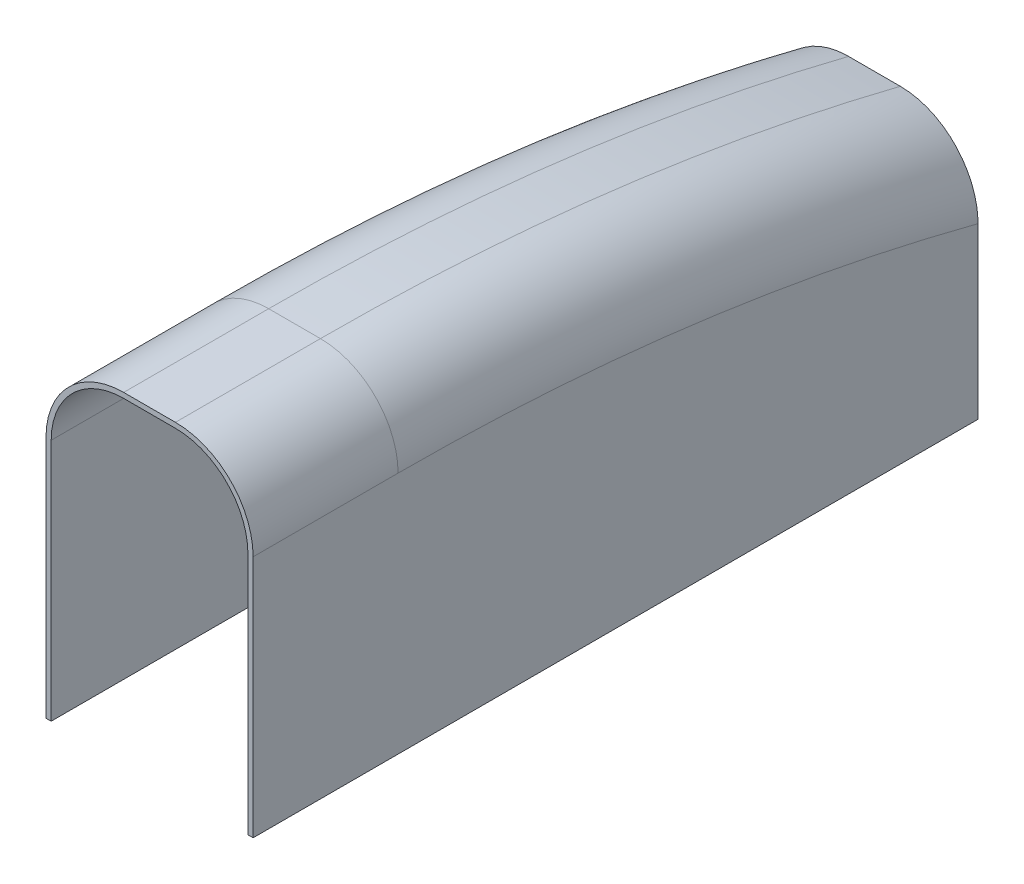
ISO-10303-21;
HEADER;
FILE_DESCRIPTION(('STEP AP214'),'2;1');
FILE_NAME('part.step','',(''),(''),'','','');
FILE_SCHEMA(('AUTOMOTIVE_DESIGN { 1 0 10303 214 1 1 1 1 }'));
ENDSEC;
DATA;
#1=APPLICATION_CONTEXT('core data for automotive mechanical design processes');
#2=APPLICATION_PROTOCOL_DEFINITION('international standard','automotive_design',2000,#1);
#3=PRODUCT_CONTEXT('',#1,'mechanical');
#4=PRODUCT('Part','Part','',(#3));
#5=PRODUCT_RELATED_PRODUCT_CATEGORY('part','',(#4));
#6=PRODUCT_DEFINITION_FORMATION('','',#4);
#7=PRODUCT_DEFINITION_CONTEXT('part definition',#1,'design');
#8=PRODUCT_DEFINITION('design','',#6,#7);
#9=PRODUCT_DEFINITION_SHAPE('','',#8);
#10=(LENGTH_UNIT() NAMED_UNIT(*) SI_UNIT(.MILLI.,.METRE.));
#11=(NAMED_UNIT(*) PLANE_ANGLE_UNIT() SI_UNIT($,.RADIAN.));
#12=(NAMED_UNIT(*) SI_UNIT($,.STERADIAN.) SOLID_ANGLE_UNIT());
#13=UNCERTAINTY_MEASURE_WITH_UNIT(LENGTH_MEASURE(1.E-05),#10,'distance_accuracy_value','');
#14=(GEOMETRIC_REPRESENTATION_CONTEXT(3) GLOBAL_UNCERTAINTY_ASSIGNED_CONTEXT((#13)) GLOBAL_UNIT_ASSIGNED_CONTEXT((#10,
#11,#12)) REPRESENTATION_CONTEXT('',''));
#15=CARTESIAN_POINT('',(0.,0.,0.));
#16=DIRECTION('',(0.,0.,1.));
#17=DIRECTION('',(1.,0.,0.));
#18=AXIS2_PLACEMENT_3D('',#15,#16,#17);
#19=CARTESIAN_POINT('',(25.4,-39.37,0.));
#20=DIRECTION('',(0.,1.,0.));
#21=DIRECTION('',(0.,0.,1.));
#22=AXIS2_PLACEMENT_3D('',#19,#20,#21);
#23=PLANE('',#22);
#24=DIRECTION('',(0.,0.,-1.));
#25=VECTOR('',#24,1.);
#26=CARTESIAN_POINT('',(-24.13,-39.37,-35.56));
#27=LINE('',#26,#25);
#28=CARTESIAN_POINT('',(-24.13,-39.37,0.));
#29=VERTEX_POINT('',#28);
#30=CARTESIAN_POINT('',(-24.13,-39.37,-176.53));
#31=VERTEX_POINT('',#30);
#32=EDGE_CURVE('E207',#29,#31,#27,.T.);
#33=ORIENTED_EDGE('',*,*,#32,.F.);
#34=DIRECTION('',(-1.,0.,0.));
#35=VECTOR('',#34,1.);
#36=CARTESIAN_POINT('',(25.4,-39.37,0.));
#37=LINE('',#36,#35);
#38=CARTESIAN_POINT('',(-25.4,-39.37,0.));
#39=VERTEX_POINT('',#38);
#40=EDGE_CURVE('E236',#29,#39,#37,.T.);
#41=ORIENTED_EDGE('',*,*,#40,.T.);
#42=DIRECTION('',(0.,0.,-1.));
#43=VECTOR('',#42,1.);
#44=CARTESIAN_POINT('',(-25.4,-39.37,0.));
#45=LINE('',#44,#43);
#46=CARTESIAN_POINT('',(-25.4,-39.37,-177.8));
#47=VERTEX_POINT('',#46);
#48=EDGE_CURVE('E213',#39,#47,#45,.T.);
#49=ORIENTED_EDGE('',*,*,#48,.T.);
#50=DIRECTION('',(-1.,0.,0.));
#51=VECTOR('',#50,1.);
#52=CARTESIAN_POINT('',(25.4,-39.37,-177.8));
#53=LINE('',#52,#51);
#54=CARTESIAN_POINT('',(25.4,-39.37,-177.8));
#55=VERTEX_POINT('',#54);
#56=EDGE_CURVE('E234',#55,#47,#53,.T.);
#57=ORIENTED_EDGE('',*,*,#56,.F.);
#58=DIRECTION('',(0.,0.,-1.));
#59=VECTOR('',#58,1.);
#60=CARTESIAN_POINT('',(25.4,-39.37,0.));
#61=LINE('',#60,#59);
#62=CARTESIAN_POINT('',(25.4,-39.37,0.));
#63=VERTEX_POINT('',#62);
#64=EDGE_CURVE('E221',#63,#55,#61,.T.);
#65=ORIENTED_EDGE('',*,*,#64,.F.);
#66=CARTESIAN_POINT('',(24.13,-39.37,0.));
#67=VERTEX_POINT('',#66);
#68=EDGE_CURVE('E237',#63,#67,#37,.T.);
#69=ORIENTED_EDGE('',*,*,#68,.T.);
#70=DIRECTION('',(0.,0.,-1.));
#71=VECTOR('',#70,1.);
#72=CARTESIAN_POINT('',(24.13,-39.37,-35.56));
#73=LINE('',#72,#71);
#74=CARTESIAN_POINT('',(24.13,-39.37,-176.53));
#75=VERTEX_POINT('',#74);
#76=EDGE_CURVE('E169',#67,#75,#73,.T.);
#77=ORIENTED_EDGE('',*,*,#76,.T.);
#78=DIRECTION('',(-1.,0.,0.));
#79=VECTOR('',#78,1.);
#80=CARTESIAN_POINT('',(25.4,-39.37,-176.53));
#81=LINE('',#80,#79);
#82=EDGE_CURVE('E166',#75,#31,#81,.T.);
#83=ORIENTED_EDGE('',*,*,#82,.T.);
#84=EDGE_LOOP('',(#33,#41,#49,#57,#65,#69,#77,#83));
#85=FACE_BOUND('',#84,.T.);
#86=ADVANCED_FACE('F35',(#85),#23,.F.);
#87=CARTESIAN_POINT('',(25.4,39.37,0.));
#88=DIRECTION('',(0.,0.,-1.));
#89=DIRECTION('',(-1.,0.,0.));
#90=AXIS2_PLACEMENT_3D('',#87,#88,#89);
#91=PLANE('',#90);
#92=CARTESIAN_POINT('',(6.34999999999999,20.32,0.));
#93=DIRECTION('',(0.,0.,-1.));
#94=DIRECTION('',(-1.,0.,0.));
#95=AXIS2_PLACEMENT_3D('',#92,#93,#94);
#96=CIRCLE('',#95,17.78);
#97=CARTESIAN_POINT('',(24.13,20.32,0.));
#98=VERTEX_POINT('',#97);
#99=CARTESIAN_POINT('',(6.34999999999999,38.1,0.));
#100=VERTEX_POINT('',#99);
#101=EDGE_CURVE('E198',#98,#100,#96,.F.);
#102=ORIENTED_EDGE('',*,*,#101,.F.);
#103=DIRECTION('',(0.,-1.,0.));
#104=VECTOR('',#103,1.);
#105=CARTESIAN_POINT('',(24.13,-546.59879710145,0.));
#106=LINE('',#105,#104);
#107=EDGE_CURVE('E194',#98,#67,#106,.T.);
#108=ORIENTED_EDGE('',*,*,#107,.T.);
#109=ORIENTED_EDGE('',*,*,#68,.F.);
#110=DIRECTION('',(0.,-1.,0.));
#111=VECTOR('',#110,1.);
#112=CARTESIAN_POINT('',(25.4,39.37,0.));
#113=LINE('',#112,#111);
#114=CARTESIAN_POINT('',(25.4,20.32,0.));
#115=VERTEX_POINT('',#114);
#116=EDGE_CURVE('E219',#115,#63,#113,.T.);
#117=ORIENTED_EDGE('',*,*,#116,.F.);
#118=CARTESIAN_POINT('',(6.34999999999999,20.32,0.));
#119=DIRECTION('',(0.,0.,-1.));
#120=DIRECTION('',(-1.,0.,0.));
#121=AXIS2_PLACEMENT_3D('',#118,#119,#120);
#122=CIRCLE('',#121,19.05);
#123=CARTESIAN_POINT('',(6.34999999999999,39.37,0.));
#124=VERTEX_POINT('',#123);
#125=EDGE_CURVE('E247',#115,#124,#122,.F.);
#126=ORIENTED_EDGE('',*,*,#125,.T.);
#127=DIRECTION('',(-1.,0.,0.));
#128=VECTOR('',#127,1.);
#129=CARTESIAN_POINT('',(25.4,39.37,0.));
#130=LINE('',#129,#128);
#131=CARTESIAN_POINT('',(-6.35,39.37,0.));
#132=VERTEX_POINT('',#131);
#133=EDGE_CURVE('E226',#124,#132,#130,.T.);
#134=ORIENTED_EDGE('',*,*,#133,.T.);
#135=CARTESIAN_POINT('',(-6.35,20.32,0.));
#136=DIRECTION('',(0.,0.,-1.));
#137=DIRECTION('',(-1.,0.,0.));
#138=AXIS2_PLACEMENT_3D('',#135,#136,#137);
#139=CIRCLE('',#138,19.05);
#140=CARTESIAN_POINT('',(-25.4,20.32,0.));
#141=VERTEX_POINT('',#140);
#142=EDGE_CURVE('E245',#132,#141,#139,.F.);
#143=ORIENTED_EDGE('',*,*,#142,.T.);
#144=DIRECTION('',(0.,-1.,0.));
#145=VECTOR('',#144,1.);
#146=CARTESIAN_POINT('',(-25.4,39.37,0.));
#147=LINE('',#146,#145);
#148=EDGE_CURVE('E210',#141,#39,#147,.T.);
#149=ORIENTED_EDGE('',*,*,#148,.T.);
#150=ORIENTED_EDGE('',*,*,#40,.F.);
#151=DIRECTION('',(0.,-1.,0.));
#152=VECTOR('',#151,1.);
#153=CARTESIAN_POINT('',(-24.13,-546.59879710145,0.));
#154=LINE('',#153,#152);
#155=CARTESIAN_POINT('',(-24.13,20.32,0.));
#156=VERTEX_POINT('',#155);
#157=EDGE_CURVE('E205',#156,#29,#154,.T.);
#158=ORIENTED_EDGE('',*,*,#157,.F.);
#159=CARTESIAN_POINT('',(-6.35,20.32,0.));
#160=DIRECTION('',(0.,0.,-1.));
#161=DIRECTION('',(-1.,0.,0.));
#162=AXIS2_PLACEMENT_3D('',#159,#160,#161);
#163=CIRCLE('',#162,17.78);
#164=CARTESIAN_POINT('',(-6.35000000000001,38.1,0.));
#165=VERTEX_POINT('',#164);
#166=EDGE_CURVE('E176',#165,#156,#163,.F.);
#167=ORIENTED_EDGE('',*,*,#166,.F.);
#168=DIRECTION('',(-1.,0.,0.));
#169=VECTOR('',#168,1.);
#170=CARTESIAN_POINT('',(25.4,38.1,0.));
#171=LINE('',#170,#169);
#172=EDGE_CURVE('E168',#100,#165,#171,.T.);
#173=ORIENTED_EDGE('',*,*,#172,.F.);
#174=EDGE_LOOP('',(#102,#108,#109,#117,#126,#134,#143,#149,#150,#158,#167,#173));
#175=FACE_BOUND('',#174,.T.);
#176=ADVANCED_FACE('F277',(#175),#91,.F.);
#177=CARTESIAN_POINT('',(25.4,-39.37,-177.8));
#178=DIRECTION('',(0.,0.,1.));
#179=DIRECTION('',(1.,0.,0.));
#180=AXIS2_PLACEMENT_3D('',#177,#178,#179);
#181=PLANE('',#180);
#182=CARTESIAN_POINT('',(0.,-11.577471892,-177.8));
#183=DIRECTION('',(0.,0.,-1.));
#184=DIRECTION('',(-1.,0.,0.));
#185=AXIS2_PLACEMENT_3D('',#182,#183,#184);
#186=CIRCLE('',#185,5.5626);
#187=CARTESIAN_POINT('',(-5.5626,-11.577471892,-177.8));
#188=VERTEX_POINT('',#187);
#189=EDGE_CURVE('E370',#188,#188,#186,.T.);
#190=ORIENTED_EDGE('',*,*,#189,.F.);
#191=EDGE_LOOP('',(#190));
#192=FACE_BOUND('',#191,.T.);
#193=DIRECTION('',(-1.,0.,0.));
#194=VECTOR('',#193,1.);
#195=CARTESIAN_POINT('',(25.4,21.8439999999999,-177.8));
#196=LINE('',#195,#194);
#197=CARTESIAN_POINT('',(6.34999999999999,21.8439999999999,-177.8));
#198=VERTEX_POINT('',#197);
#199=CARTESIAN_POINT('',(-6.35,21.8439999999999,-177.8));
#200=VERTEX_POINT('',#199);
#201=EDGE_CURVE('E232',#198,#200,#196,.T.);
#202=ORIENTED_EDGE('',*,*,#201,.F.);
#203=CARTESIAN_POINT('',(6.34999999999999,21.8439999999999,-177.8));
#204=CARTESIAN_POINT('',(6.61205841045894,21.8440007838025,-177.8));
#205=CARTESIAN_POINT('',(6.87408711009704,21.8384250964838,-177.8));
#206=CARTESIAN_POINT('',(7.39766374248422,21.8161411274538,-177.8));
#207=CARTESIAN_POINT('',(7.65921168782267,21.7994331415486,-177.8));
#208=CARTESIAN_POINT('',(8.44235666190795,21.7326550209048,-177.8));
#209=CARTESIAN_POINT('',(8.96262261136264,21.6659306956914,-177.8));
#210=CARTESIAN_POINT('',(9.99480915490303,21.4887470402704,-177.8));
#211=CARTESIAN_POINT('',(10.5067415413498,21.378356358864,-177.8));
#212=CARTESIAN_POINT('',(11.2661423104182,21.1807218904375,-177.8));
#213=CARTESIAN_POINT('',(11.5178716029029,21.1094980942603,-177.8));
#214=CARTESIAN_POINT('',(12.0181687037809,20.9564910662638,-177.8));
#215=CARTESIAN_POINT('',(12.2667357122308,20.8747052187627,-177.8));
#216=CARTESIAN_POINT('',(13.0069388684089,20.6137676523504,-177.8));
#217=CARTESIAN_POINT('',(13.4931653759836,20.4190129203108,-177.8));
#218=CARTESIAN_POINT('',(14.4476216639608,19.9895119885974,-177.8));
#219=CARTESIAN_POINT('',(14.915851149776,19.7547651346471,-177.8));
#220=CARTESIAN_POINT('',(15.6022820846754,19.3741091020478,-177.8));
#221=CARTESIAN_POINT('',(15.8284800873991,19.2424411113737,-177.8));
#222=CARTESIAN_POINT('',(16.2751641912999,18.9698755984607,-177.8));
#223=CARTESIAN_POINT('',(16.4956517444451,18.8289804551627,-177.8));
#224=CARTESIAN_POINT('',(17.1481305960217,18.3927728379184,-177.8));
#225=CARTESIAN_POINT('',(17.5711752700039,18.0839175376661,-177.8));
#226=CARTESIAN_POINT('',(18.395614616662,17.4284868393061,-177.8));
#227=CARTESIAN_POINT('',(18.796669308395,17.0814851755625,-177.8));
#228=CARTESIAN_POINT('',(19.5688222887623,16.3555989573563,-177.8));
#229=CARTESIAN_POINT('',(19.9399202885047,15.976714095495,-177.8));
#230=CARTESIAN_POINT('',(20.6499402176467,15.1897887957031,-177.8));
#231=CARTESIAN_POINT('',(20.9888557966998,14.7817426312882,-177.8));
#232=CARTESIAN_POINT('',(21.6324306511748,13.939484568928,-177.8));
#233=CARTESIAN_POINT('',(21.9370896988503,13.5052724970543,-177.8));
#234=CARTESIAN_POINT('',(22.5185929653271,12.6009846725812,-177.8));
#235=CARTESIAN_POINT('',(22.7943960745817,12.1302392658745,-177.8));
#236=CARTESIAN_POINT('',(23.3063265870179,11.1676214735742,-177.8));
#237=CARTESIAN_POINT('',(23.5424515204726,10.6757477752629,-177.8));
#238=CARTESIAN_POINT('',(23.9736528680695,9.67440376926704,-177.8));
#239=CARTESIAN_POINT('',(24.1687336503794,9.16493534084569,-177.8));
#240=CARTESIAN_POINT('',(24.5167944476155,8.13187880972728,-177.8));
#241=CARTESIAN_POINT('',(24.6697812785725,7.60829300806871,-177.8));
#242=CARTESIAN_POINT('',(24.9008104719818,6.67944545820118,-177.8));
#243=CARTESIAN_POINT('',(24.9880309444401,6.27643787387283,-177.8));
#244=CARTESIAN_POINT('',(25.1377059305158,5.46585217716446,-177.8));
#245=CARTESIAN_POINT('',(25.200161685527,5.05827429493554,-177.8));
#246=CARTESIAN_POINT('',(25.3000488001704,4.24069234562201,-177.8));
#247=CARTESIAN_POINT('',(25.3375176674705,3.83069285126902,-177.8));
#248=CARTESIAN_POINT('',(25.3875015191361,3.00911499413814,-177.8));
#249=CARTESIAN_POINT('',(25.4000128350265,2.59753640815872,-177.8));
#250=CARTESIAN_POINT('',(25.4,2.18595569964131,-177.8));
#251=B_SPLINE_CURVE_WITH_KNOTS('',3,(#203,#204,#205,#206,#207,#208,#209,#210,#211,#212,#213,
#214,#215,#216,#217,#218,#219,#220,#221,#222,#223,#224,#225,#226,#227,#228,#229,#230,#231,#232,
#233,#234,#235,#236,#237,#238,#239,#240,#241,#242,#243,#244,#245,#246,#247,#248,#249,#250),
.UNSPECIFIED.,.F.,.F.,(4,2,2,2,2,2,2,2,2,2,2,2,2,2,2,2,2,2,2,2,2,2,2,4),(0.,0.786056684674552,
1.572092483178,3.14366239415842,4.71277136428642,5.49740197364792,6.28222726998621,
7.851605224004,9.42100885572241,10.2059978115732,10.9907851726266,12.5602327084272,
14.1494566604224,15.7386959365114,17.3282481579566,18.9178109465407,20.552708905879,
22.1877085900858,23.8225341795812,25.4570948951991,26.6933831904519,27.9296095058104,
29.1639759268974,30.3985237723957),.UNSPECIFIED.);
#252=CARTESIAN_POINT('',(25.4,2.18595569964129,-177.8));
#253=VERTEX_POINT('',#252);
#254=EDGE_CURVE('E11',#198,#253,#251,.T.);
#255=ORIENTED_EDGE('',*,*,#254,.T.);
#256=DIRECTION('',(0.,1.,0.));
#257=VECTOR('',#256,1.);
#258=CARTESIAN_POINT('',(25.4,-39.37,-177.8));
#259=LINE('',#258,#257);
#260=EDGE_CURVE('E223',#55,#253,#259,.T.);
#261=ORIENTED_EDGE('',*,*,#260,.F.);
#262=ORIENTED_EDGE('',*,*,#56,.T.);
#263=DIRECTION('',(0.,1.,0.));
#264=VECTOR('',#263,1.);
#265=CARTESIAN_POINT('',(-25.4,-39.37,-177.8));
#266=LINE('',#265,#264);
#267=CARTESIAN_POINT('',(-25.4,2.18595569964129,-177.8));
#268=VERTEX_POINT('',#267);
#269=EDGE_CURVE('E217',#47,#268,#266,.T.);
#270=ORIENTED_EDGE('',*,*,#269,.T.);
#271=CARTESIAN_POINT('',(-25.4,2.18595569964131,-177.8));
#272=CARTESIAN_POINT('',(-25.4000415135795,2.75231635142593,-177.8));
#273=CARTESIAN_POINT('',(-25.3763332851994,3.31864450874778,-177.8));
#274=CARTESIAN_POINT('',(-25.2817124088729,4.44735833446594,-177.8));
#275=CARTESIAN_POINT('',(-25.2107985066367,5.00974389770337,-177.8));
#276=CARTESIAN_POINT('',(-25.0220388000799,6.1267981255158,-177.8));
#277=CARTESIAN_POINT('',(-24.9041817721324,6.68146491176291,-177.8));
#278=CARTESIAN_POINT('',(-24.6927677190361,7.50437628745211,-177.8));
#279=CARTESIAN_POINT('',(-24.616522054995,7.77717357751472,-177.8));
#280=CARTESIAN_POINT('',(-24.4525667791737,8.31938216923644,-177.8));
#281=CARTESIAN_POINT('',(-24.3648541111014,8.5887925471253,-177.8));
#282=CARTESIAN_POINT('',(-24.0845873526804,9.3914691734656,-177.8));
#283=CARTESIAN_POINT('',(-23.8749806612063,9.91888433852125,-177.8));
#284=CARTESIAN_POINT('',(-23.4116040617842,10.9539443718113,-177.8));
#285=CARTESIAN_POINT('',(-23.1578350232046,11.4615896289902,-177.8));
#286=CARTESIAN_POINT('',(-22.7453542614121,12.2051638839274,-177.8));
#287=CARTESIAN_POINT('',(-22.6025612400876,12.450032115796,-177.8));
#288=CARTESIAN_POINT('',(-22.3066077696807,12.933332346707,-177.8));
#289=CARTESIAN_POINT('',(-22.1534499873178,13.1717659793719,-177.8));
#290=CARTESIAN_POINT('',(-21.6787035953435,13.8768340000955,-177.8));
#291=CARTESIAN_POINT('',(-21.3418072735664,14.3332980335458,-177.8));
#292=CARTESIAN_POINT('',(-20.6354385558574,15.2078939207457,-177.8));
#293=CARTESIAN_POINT('',(-20.2665900060768,15.6265311088572,-177.8));
#294=CARTESIAN_POINT('',(-19.4941389059355,16.4304282331155,-177.8));
#295=CARTESIAN_POINT('',(-19.0905363680386,16.8156881812322,-177.8));
#296=CARTESIAN_POINT('',(-18.2512020169471,17.5497481216985,-177.8));
#297=CARTESIAN_POINT('',(-17.8154646013257,17.8985417307219,-177.8));
#298=CARTESIAN_POINT('',(-17.1403487040597,18.3919666446733,-177.8));
#299=CARTESIAN_POINT('',(-16.9117177523811,18.5514851443461,-177.8));
#300=CARTESIAN_POINT('',(-16.4475900385088,18.8603471907642,-177.8));
#301=CARTESIAN_POINT('',(-16.2120914157471,19.009687942924,-177.8));
#302=CARTESIAN_POINT('',(-15.5104532868729,19.4331631809386,-177.8));
#303=CARTESIAN_POINT('',(-15.0354372238008,19.6927644807175,-177.8));
#304=CARTESIAN_POINT('',(-14.0647864034185,20.1700287379818,-177.8));
#305=CARTESIAN_POINT('',(-13.569152258464,20.3876929399167,-177.8));
#306=CARTESIAN_POINT('',(-12.8132493836359,20.68124808136,-177.8));
#307=CARTESIAN_POINT('',(-12.5592681409545,20.7735916186905,-177.8));
#308=CARTESIAN_POINT('',(-12.0475997831001,20.947134206994,-177.8));
#309=CARTESIAN_POINT('',(-11.7899136759113,21.0283362281465,-177.8));
#310=CARTESIAN_POINT('',(-11.0120572042881,21.2549463560619,-177.8));
#311=CARTESIAN_POINT('',(-10.486871023338,21.3834430625099,-177.8));
#312=CARTESIAN_POINT('',(-9.36312482909715,21.6068208355164,-177.8));
#313=CARTESIAN_POINT('',(-8.76337054867519,21.6957594596433,-177.8));
#314=CARTESIAN_POINT('',(-7.86002114275575,21.7846932967395,-177.8));
#315=CARTESIAN_POINT('',(-7.55846327311519,21.8069255314707,-177.8));
#316=CARTESIAN_POINT('',(-6.95462038761113,21.8365790780962,-177.8));
#317=CARTESIAN_POINT('',(-6.65233537216778,21.8440003985462,-177.8));
#318=CARTESIAN_POINT('',(-6.35000000000001,21.8439999999999,-177.8));
#319=B_SPLINE_CURVE_WITH_KNOTS('',3,(#271,#272,#273,#274,#275,#276,#277,#278,#279,#280,#281,
#282,#283,#284,#285,#286,#287,#288,#289,#290,#291,#292,#293,#294,#295,#296,#297,#298,#299,#300,
#301,#302,#303,#304,#305,#306,#307,#308,#309,#310,#311,#312,#313,#314,#315,#316,#317,#318),
.UNSPECIFIED.,.F.,.F.,(4,2,2,2,2,2,2,2,2,2,2,2,2,2,2,2,2,2,2,2,2,2,2,4),(0.,1.69852182823435,
3.39708878925577,5.09606210448301,5.94560132721085,6.79536744038791,8.49581525462912,
10.1962295980877,11.0463821327477,11.8963167596487,13.5959722613307,15.2677928896639,
16.9396129184401,18.6117251061752,19.4478325928639,20.2841687389362,21.9060266200282,
23.5278363663875,24.3383572008307,25.1486615396573,26.7685721570246,28.5843324629022,
29.4911476821613,30.3979623775878),.UNSPECIFIED.);
#320=EDGE_CURVE('E45',#268,#200,#319,.T.);
#321=ORIENTED_EDGE('',*,*,#320,.T.);
#322=EDGE_LOOP('',(#202,#255,#261,#262,#270,#321));
#323=FACE_BOUND('',#322,.T.);
#324=ADVANCED_FACE('F271',(#192,#323),#181,.F.);
#325=CARTESIAN_POINT('',(25.4,-546.59879710145,-35.56));
#326=DIRECTION('',(-1.,0.,0.));
#327=DIRECTION('',(0.,0.,1.));
#328=AXIS2_PLACEMENT_3D('',#325,#326,#327);
#329=CYLINDRICAL_SURFACE('',#328,585.96879710145);
#330=DIRECTION('',(-1.,0.,0.));
#331=VECTOR('',#330,1.);
#332=CARTESIAN_POINT('',(25.4,39.37,-35.56));
#333=LINE('',#332,#331);
#334=CARTESIAN_POINT('',(6.34999999999999,39.37,-35.56));
#335=VERTEX_POINT('',#334);
#336=CARTESIAN_POINT('',(-6.35,39.37,-35.56));
#337=VERTEX_POINT('',#336);
#338=EDGE_CURVE('E229',#335,#337,#333,.T.);
#339=ORIENTED_EDGE('',*,*,#338,.F.);
#340=CARTESIAN_POINT('',(6.34999999999999,-546.59879710145,-35.56));
#341=DIRECTION('',(-1.,0.,0.));
#342=DIRECTION('',(0.,0.,1.));
#343=AXIS2_PLACEMENT_3D('',#340,#341,#342);
#344=CIRCLE('',#343,585.96879710145);
#345=EDGE_CURVE('E260',#335,#198,#344,.T.);
#346=ORIENTED_EDGE('',*,*,#345,.T.);
#347=ORIENTED_EDGE('',*,*,#201,.T.);
#348=CARTESIAN_POINT('',(-6.35,-546.59879710145,-35.56));
#349=DIRECTION('',(-1.,0.,0.));
#350=DIRECTION('',(0.,0.,1.));
#351=AXIS2_PLACEMENT_3D('',#348,#349,#350);
#352=CIRCLE('',#351,585.96879710145);
#353=EDGE_CURVE('E258',#200,#337,#352,.F.);
#354=ORIENTED_EDGE('',*,*,#353,.T.);
#355=EDGE_LOOP('',(#339,#346,#347,#354));
#356=FACE_BOUND('',#355,.T.);
#357=ADVANCED_FACE('F276',(#356),#329,.T.);
#358=CARTESIAN_POINT('',(25.4,39.37,0.));
#359=DIRECTION('',(0.,-1.,0.));
#360=DIRECTION('',(0.,0.,-1.));
#361=AXIS2_PLACEMENT_3D('',#358,#359,#360);
#362=PLANE('',#361);
#363=ORIENTED_EDGE('',*,*,#133,.F.);
#364=DIRECTION('',(0.,0.,1.));
#365=VECTOR('',#364,1.);
#366=CARTESIAN_POINT('',(6.34999999999999,39.37,0.));
#367=LINE('',#366,#365);
#368=EDGE_CURVE('E252',#124,#335,#367,.F.);
#369=ORIENTED_EDGE('',*,*,#368,.T.);
#370=ORIENTED_EDGE('',*,*,#338,.T.);
#371=DIRECTION('',(0.,0.,1.));
#372=VECTOR('',#371,1.);
#373=CARTESIAN_POINT('',(-6.35,39.37,0.));
#374=LINE('',#373,#372);
#375=EDGE_CURVE('E249',#337,#132,#374,.T.);
#376=ORIENTED_EDGE('',*,*,#375,.T.);
#377=EDGE_LOOP('',(#363,#369,#370,#376));
#378=FACE_BOUND('',#377,.T.);
#379=ADVANCED_FACE('F335',(#378),#362,.F.);
#380=CARTESIAN_POINT('',(25.4,-546.59879710145,-35.56));
#381=DIRECTION('',(-1.,0.,0.));
#382=DIRECTION('',(0.,0.,1.));
#383=AXIS2_PLACEMENT_3D('',#380,#381,#382);
#384=PLANE('',#383);
#385=CARTESIAN_POINT('',(25.4,-546.59879710145,-35.56));
#386=DIRECTION('',(-1.,0.,0.));
#387=DIRECTION('',(0.,0.,1.));
#388=AXIS2_PLACEMENT_3D('',#385,#386,#387);
#389=CIRCLE('',#388,566.91879710145);
#390=CARTESIAN_POINT('',(25.4,20.3199999999999,-35.56));
#391=VERTEX_POINT('',#390);
#392=EDGE_CURVE('E240',#253,#391,#389,.F.);
#393=ORIENTED_EDGE('',*,*,#392,.T.);
#394=DIRECTION('',(0.,0.,1.));
#395=VECTOR('',#394,1.);
#396=CARTESIAN_POINT('',(25.4,20.32,-35.56));
#397=LINE('',#396,#395);
#398=EDGE_CURVE('E242',#391,#115,#397,.T.);
#399=ORIENTED_EDGE('',*,*,#398,.T.);
#400=ORIENTED_EDGE('',*,*,#116,.T.);
#401=ORIENTED_EDGE('',*,*,#64,.T.);
#402=ORIENTED_EDGE('',*,*,#260,.T.);
#403=EDGE_LOOP('',(#393,#399,#400,#401,#402));
#404=FACE_BOUND('',#403,.T.);
#405=ADVANCED_FACE('F323',(#404),#384,.F.);
#406=CARTESIAN_POINT('',(-25.4,-546.59879710145,-35.56));
#407=DIRECTION('',(-1.,0.,0.));
#408=DIRECTION('',(0.,0.,1.));
#409=AXIS2_PLACEMENT_3D('',#406,#407,#408);
#410=PLANE('',#409);
#411=ORIENTED_EDGE('',*,*,#148,.F.);
#412=DIRECTION('',(0.,0.,1.));
#413=VECTOR('',#412,1.);
#414=CARTESIAN_POINT('',(-25.4,20.32,-35.56));
#415=LINE('',#414,#413);
#416=CARTESIAN_POINT('',(-25.4,20.3199999999999,-35.56));
#417=VERTEX_POINT('',#416);
#418=EDGE_CURVE('E256',#141,#417,#415,.F.);
#419=ORIENTED_EDGE('',*,*,#418,.T.);
#420=CARTESIAN_POINT('',(-25.4,-546.59879710145,-35.56));
#421=DIRECTION('',(-1.,0.,0.));
#422=DIRECTION('',(0.,0.,1.));
#423=AXIS2_PLACEMENT_3D('',#420,#421,#422);
#424=CIRCLE('',#423,566.91879710145);
#425=EDGE_CURVE('E254',#417,#268,#424,.T.);
#426=ORIENTED_EDGE('',*,*,#425,.T.);
#427=ORIENTED_EDGE('',*,*,#269,.F.);
#428=ORIENTED_EDGE('',*,*,#48,.F.);
#429=EDGE_LOOP('',(#411,#419,#426,#427,#428));
#430=FACE_BOUND('',#429,.T.);
#431=ADVANCED_FACE('F293',(#430),#410,.T.);
#432=CARTESIAN_POINT('',(6.34999999999999,-546.59879710145,-35.56));
#433=DIRECTION('',(-1.,0.,0.));
#434=DIRECTION('',(0.,0.,1.));
#435=AXIS2_PLACEMENT_3D('',#432,#433,#434);
#436=TOROIDAL_SURFACE('',#435,566.91879710145,19.05);
#437=ORIENTED_EDGE('',*,*,#254,.F.);
#438=ORIENTED_EDGE('',*,*,#345,.F.);
#439=CARTESIAN_POINT('',(6.34999999999999,20.3199999999999,-35.56));
#440=DIRECTION('',(0.,0.,1.));
#441=DIRECTION('',(1.,0.,0.));
#442=AXIS2_PLACEMENT_3D('',#439,#440,#441);
#443=CIRCLE('',#442,19.05);
#444=EDGE_CURVE('E214',#391,#335,#443,.T.);
#445=ORIENTED_EDGE('',*,*,#444,.F.);
#446=ORIENTED_EDGE('',*,*,#392,.F.);
#447=EDGE_LOOP('',(#437,#438,#445,#446));
#448=FACE_BOUND('',#447,.T.);
#449=ADVANCED_FACE('F289',(#448),#436,.T.);
#450=CARTESIAN_POINT('',(6.34999999999999,20.32,-35.56));
#451=DIRECTION('',(0.,0.,1.));
#452=DIRECTION('',(1.,0.,0.));
#453=AXIS2_PLACEMENT_3D('',#450,#451,#452);
#454=CYLINDRICAL_SURFACE('',#453,19.05);
#455=ORIENTED_EDGE('',*,*,#444,.T.);
#456=ORIENTED_EDGE('',*,*,#368,.F.);
#457=ORIENTED_EDGE('',*,*,#125,.F.);
#458=ORIENTED_EDGE('',*,*,#398,.F.);
#459=EDGE_LOOP('',(#455,#456,#457,#458));
#460=FACE_BOUND('',#459,.T.);
#461=ADVANCED_FACE('F287',(#460),#454,.T.);
#462=CARTESIAN_POINT('',(-6.35,-546.59879710145,-35.56));
#463=DIRECTION('',(-1.,0.,0.));
#464=DIRECTION('',(0.,0.,1.));
#465=AXIS2_PLACEMENT_3D('',#462,#463,#464);
#466=TOROIDAL_SURFACE('',#465,566.91879710145,19.05);
#467=ORIENTED_EDGE('',*,*,#320,.F.);
#468=ORIENTED_EDGE('',*,*,#425,.F.);
#469=CARTESIAN_POINT('',(-6.35,20.3199999999999,-35.56));
#470=DIRECTION('',(0.,0.,1.));
#471=DIRECTION('',(1.,0.,0.));
#472=AXIS2_PLACEMENT_3D('',#469,#470,#471);
#473=CIRCLE('',#472,19.05);
#474=EDGE_CURVE('E161',#337,#417,#473,.T.);
#475=ORIENTED_EDGE('',*,*,#474,.F.);
#476=ORIENTED_EDGE('',*,*,#353,.F.);
#477=EDGE_LOOP('',(#467,#468,#475,#476));
#478=FACE_BOUND('',#477,.T.);
#479=ADVANCED_FACE('F37',(#478),#466,.T.);
#480=CARTESIAN_POINT('',(-6.35,20.32,0.));
#481=DIRECTION('',(0.,0.,-1.));
#482=DIRECTION('',(-1.,0.,0.));
#483=AXIS2_PLACEMENT_3D('',#480,#481,#482);
#484=CYLINDRICAL_SURFACE('',#483,19.05);
#485=ORIENTED_EDGE('',*,*,#474,.T.);
#486=ORIENTED_EDGE('',*,*,#418,.F.);
#487=ORIENTED_EDGE('',*,*,#142,.F.);
#488=ORIENTED_EDGE('',*,*,#375,.F.);
#489=EDGE_LOOP('',(#485,#486,#487,#488));
#490=FACE_BOUND('',#489,.T.);
#491=ADVANCED_FACE('F295',(#490),#484,.T.);
#492=CARTESIAN_POINT('',(25.4,-39.37,-176.53));
#493=DIRECTION('',(0.,0.,1.));
#494=DIRECTION('',(1.,0.,0.));
#495=AXIS2_PLACEMENT_3D('',#492,#493,#494);
#496=PLANE('',#495);
#497=CARTESIAN_POINT('',(0.,-11.577471892,-176.53));
#498=DIRECTION('',(0.,0.,1.));
#499=DIRECTION('',(1.,0.,0.));
#500=AXIS2_PLACEMENT_3D('',#497,#498,#499);
#501=CIRCLE('',#500,5.5626);
#502=CARTESIAN_POINT('',(5.5626,-11.577471892,-176.53));
#503=VERTEX_POINT('',#502);
#504=EDGE_CURVE('E40',#503,#503,#501,.T.);
#505=ORIENTED_EDGE('',*,*,#504,.F.);
#506=EDGE_LOOP('',(#505));
#507=FACE_BOUND('',#506,.T.);
#508=DIRECTION('',(-1.,0.,0.));
#509=VECTOR('',#508,1.);
#510=CARTESIAN_POINT('',(6.34999999999999,20.8517667645862,-176.53));
#511=LINE('',#510,#509);
#512=CARTESIAN_POINT('',(6.34999999999999,20.8517667645862,-176.53));
#513=VERTEX_POINT('',#512);
#514=CARTESIAN_POINT('',(-6.35,20.8517667645862,-176.53));
#515=VERTEX_POINT('',#514);
#516=EDGE_CURVE('E178',#513,#515,#511,.T.);
#517=ORIENTED_EDGE('',*,*,#516,.T.);
#518=CARTESIAN_POINT('',(-24.13,2.51356080625076,-176.53));
#519=CARTESIAN_POINT('',(-24.1300389028094,3.04166838242579,-176.53));
#520=CARTESIAN_POINT('',(-24.1079261550682,3.56974535867141,-176.53));
#521=CARTESIAN_POINT('',(-24.0196762512569,4.62222057852132,-176.53));
#522=CARTESIAN_POINT('',(-23.9535380117269,5.14661873126942,-176.53));
#523=CARTESIAN_POINT('',(-23.7774968311618,6.18820608928655,-176.53));
#524=CARTESIAN_POINT('',(-23.6675843400546,6.70539369595602,-176.53));
#525=CARTESIAN_POINT('',(-23.4704274294322,7.47269944012382,-176.53));
#526=CARTESIAN_POINT('',(-23.3993243736991,7.72706321739158,-176.53));
#527=CARTESIAN_POINT('',(-23.2464297207846,8.23263336388403,-176.53));
#528=CARTESIAN_POINT('',(-23.1646352766172,8.48383887249962,-176.53));
#529=CARTESIAN_POINT('',(-22.9032845132015,9.23227112135702,-176.53));
#530=CARTESIAN_POINT('',(-22.7078303966828,9.72404244356843,-176.53));
#531=CARTESIAN_POINT('',(-22.2757544086421,10.6891551667317,-176.53));
#532=CARTESIAN_POINT('',(-22.03913333053,11.1624969226611,-176.53));
#533=CARTESIAN_POINT('',(-21.6545360396196,11.855833558138,-176.53));
#534=CARTESIAN_POINT('',(-21.5213969864668,12.0841600101613,-176.53));
#535=CARTESIAN_POINT('',(-21.2454562203823,12.5348146626708,-176.53));
#536=CARTESIAN_POINT('',(-21.1026569927573,12.7571443855229,-176.53));
#537=CARTESIAN_POINT('',(-20.6600251872736,13.414598096752,-176.53));
#538=CARTESIAN_POINT('',(-20.3459263192291,13.8402446437356,-176.53));
#539=CARTESIAN_POINT('',(-19.6872510814113,14.6559700199386,-176.53));
#540=CARTESIAN_POINT('',(-19.34324307575,15.0465091375462,-176.53));
#541=CARTESIAN_POINT('',(-18.6228185149151,15.7964711725278,-176.53));
#542=CARTESIAN_POINT('',(-18.2464019663795,16.1558940962751,-176.53));
#543=CARTESIAN_POINT('',(-17.4636093402336,16.8407546134754,-176.53));
#544=CARTESIAN_POINT('',(-17.0572280293386,17.1661862463214,-176.53));
#545=CARTESIAN_POINT('',(-16.4275986267674,17.6265918422849,-176.53));
#546=CARTESIAN_POINT('',(-16.2143723602952,17.7754408993761,-176.53));
#547=CARTESIAN_POINT('',(-15.781517543404,18.0636563261624,-176.53));
#548=CARTESIAN_POINT('',(-15.5618872595742,18.20302009374,-176.53));
#549=CARTESIAN_POINT('',(-14.9073048490803,18.5983586487791,-176.53));
#550=CARTESIAN_POINT('',(-14.4640634029915,18.8407707280457,-176.53));
#551=CARTESIAN_POINT('',(-13.5583313634731,19.2864739641658,-176.53));
#552=CARTESIAN_POINT('',(-13.0958413319408,19.4897662620162,-176.53));
#553=CARTESIAN_POINT('',(-12.3904780396339,19.7639782581376,-176.53));
#554=CARTESIAN_POINT('',(-12.1534757662314,19.8502445732913,-176.53));
#555=CARTESIAN_POINT('',(-11.6760102284916,20.0123818548536,-176.53));
#556=CARTESIAN_POINT('',(-11.4355479058687,20.0882555927881,-176.53));
#557=CARTESIAN_POINT('',(-10.7096784341925,20.3000237393229,-176.53));
#558=CARTESIAN_POINT('',(-10.2195864266126,20.4201437501376,-176.53));
#559=CARTESIAN_POINT('',(-9.16945011053958,20.6293521435879,-176.53));
#560=CARTESIAN_POINT('',(-8.60826020329639,20.7127540986131,-176.53));
#561=CARTESIAN_POINT('',(-7.76297949134509,20.7961517638444,-176.53));
#562=CARTESIAN_POINT('',(-7.48080294887945,20.817000081687,-176.53));
#563=CARTESIAN_POINT('',(-6.91576674294135,20.8448077461497,-176.53));
#564=CARTESIAN_POINT('',(-6.63290708042817,20.8517671122623,-176.53));
#565=CARTESIAN_POINT('',(-6.34999999999999,20.8517667645861,-176.53));
#566=B_SPLINE_CURVE_WITH_KNOTS('',3,(#518,#519,#520,#521,#522,#523,#524,#525,#526,#527,#528,
#529,#530,#531,#532,#533,#534,#535,#536,#537,#538,#539,#540,#541,#542,#543,#544,#545,#546,#547,
#548,#549,#550,#551,#552,#553,#554,#555,#556,#557,#558,#559,#560,#561,#562,#563,#564,#565),
.UNSPECIFIED.,.F.,.F.,(4,2,2,2,2,2,2,2,2,2,2,2,2,2,2,2,2,2,2,2,2,2,2,4),(0.,1.58379973951581,
3.16763845751308,4.75182290539409,5.54396457912952,6.33631762186929,7.92186078158096,
9.5073733865453,10.3000833741977,11.0925901885634,12.6774054733296,14.2368514054875,
15.7962970182327,17.3560156330244,18.1359231003161,18.9160436658413,20.4296666128892,
21.9432454057841,22.6996805799592,23.4559136311664,24.9677306896216,26.6668027288139,
27.5153450805134,28.3638862413216),.UNSPECIFIED.);
#567=CARTESIAN_POINT('',(-24.13,2.51356080625076,-176.53));
#568=VERTEX_POINT('',#567);
#569=EDGE_CURVE('E162',#568,#515,#566,.T.);
#570=ORIENTED_EDGE('',*,*,#569,.F.);
#571=DIRECTION('',(0.,1.,0.));
#572=VECTOR('',#571,1.);
#573=CARTESIAN_POINT('',(-24.13,-546.59879710145,-176.53));
#574=LINE('',#573,#572);
#575=EDGE_CURVE('E197',#31,#568,#574,.T.);
#576=ORIENTED_EDGE('',*,*,#575,.F.);
#577=ORIENTED_EDGE('',*,*,#82,.F.);
#578=DIRECTION('',(0.,1.,0.));
#579=VECTOR('',#578,1.);
#580=CARTESIAN_POINT('',(24.13,-546.59879710145,-176.53));
#581=LINE('',#580,#579);
#582=CARTESIAN_POINT('',(24.13,2.51356080625076,-176.53));
#583=VERTEX_POINT('',#582);
#584=EDGE_CURVE('E53',#75,#583,#581,.T.);
#585=ORIENTED_EDGE('',*,*,#584,.T.);
#586=CARTESIAN_POINT('',(6.34999999999999,20.8517667645862,-176.53));
#587=CARTESIAN_POINT('',(6.59466603947703,20.8517674912983,-176.53));
#588=CARTESIAN_POINT('',(6.83930434647168,20.8465623948597,-176.53));
#589=CARTESIAN_POINT('',(7.32813219871112,20.8257595050511,-176.53));
#590=CARTESIAN_POINT('',(7.57232175569318,20.810161987494,-176.53));
#591=CARTESIAN_POINT('',(8.30349164293914,20.7478220461346,-176.53));
#592=CARTESIAN_POINT('',(8.78922948208213,20.685532208047,-176.53));
#593=CARTESIAN_POINT('',(9.75291964155664,20.5201222461717,-176.53));
#594=CARTESIAN_POINT('',(10.2308829005149,20.4170658077156,-176.53));
#595=CARTESIAN_POINT('',(10.9398946932219,20.2325601159606,-176.53));
#596=CARTESIAN_POINT('',(11.1749209621172,20.1660674358021,-176.53));
#597=CARTESIAN_POINT('',(11.6420220505575,20.0232233420162,-176.53));
#598=CARTESIAN_POINT('',(11.8740961230076,19.9468694853329,-176.53));
#599=CARTESIAN_POINT('',(12.5651872104593,19.7032607721323,-176.53));
#600=CARTESIAN_POINT('',(13.0191537283577,19.5214377644415,-176.53));
#601=CARTESIAN_POINT('',(13.9102833935735,19.1204505071795,-176.53));
#602=CARTESIAN_POINT('',(14.3474462691451,18.9012856540329,-176.53));
#603=CARTESIAN_POINT('',(14.9883305599824,18.5458920924096,-176.53));
#604=CARTESIAN_POINT('',(15.199519017419,18.4229617598592,-176.53));
#605=CARTESIAN_POINT('',(15.6165620050585,18.1684823187135,-176.53));
#606=CARTESIAN_POINT('',(15.8224178910972,18.0369354315437,-176.53));
#607=CARTESIAN_POINT('',(16.4315957068257,17.629666953996,-176.53));
#608=CARTESIAN_POINT('',(16.8265626006631,17.3412982283469,-176.53));
#609=CARTESIAN_POINT('',(17.5962159396972,16.7293796313399,-176.53));
#610=CARTESIAN_POINT('',(17.9705886601791,16.4054364411799,-176.53));
#611=CARTESIAN_POINT('',(18.6913600495442,15.7277800387376,-176.53));
#612=CARTESIAN_POINT('',(19.0377584498837,15.3740665407373,-176.53));
#613=CARTESIAN_POINT('',(19.7005047118129,14.6394138967914,-176.53));
#614=CARTESIAN_POINT('',(20.0168466209551,14.2584693840293,-176.53));
#615=CARTESIAN_POINT('',(20.6175324422467,13.4721456050802,-176.53));
#616=CARTESIAN_POINT('',(20.9018761507448,13.0667661834034,-176.53));
#617=CARTESIAN_POINT('',(21.4444656847434,12.2226830310587,-176.53));
#618=CARTESIAN_POINT('',(21.7017525320026,11.7833627019181,-176.53));
#619=CARTESIAN_POINT('',(22.1792850234717,10.8850068620425,-176.53));
#620=CARTESIAN_POINT('',(22.3995283607822,10.4259701256935,-176.53));
#621=CARTESIAN_POINT('',(22.8016860180251,9.49148020002951,-176.53));
#622=CARTESIAN_POINT('',(22.98360469453,9.01602888380827,-176.53));
#623=CARTESIAN_POINT('',(23.3081279445588,8.05195344981158,-176.53));
#624=CARTESIAN_POINT('',(23.4507389320939,7.56333149544957,-176.53));
#625=CARTESIAN_POINT('',(23.665827593084,6.69734961873256,-176.53));
#626=CARTESIAN_POINT('',(23.7469277744672,6.32210420138729,-176.53));
#627=CARTESIAN_POINT('',(23.8861013618902,5.56736962866753,-176.53));
#628=CARTESIAN_POINT('',(23.9441759349939,5.18788068938069,-176.53));
#629=CARTESIAN_POINT('',(24.0370570883188,4.42665031955215,-176.53));
#630=CARTESIAN_POINT('',(24.071898480514,4.04491312756783,-176.53));
#631=CARTESIAN_POINT('',(24.1183776352334,3.27997172134974,-176.53));
#632=CARTESIAN_POINT('',(24.1300119488208,2.89676729753965,-176.53));
#633=CARTESIAN_POINT('',(24.13,2.51356080625076,-176.53));
#634=B_SPLINE_CURVE_WITH_KNOTS('',3,(#586,#587,#588,#589,#590,#591,#592,#593,#594,#595,#596,
#597,#598,#599,#600,#601,#602,#603,#604,#605,#606,#607,#608,#609,#610,#611,#612,#613,#614,#615,
#616,#617,#618,#619,#620,#621,#622,#623,#624,#625,#626,#627,#628,#629,#630,#631,#632,#633),
.UNSPECIFIED.,.F.,.F.,(4,2,2,2,2,2,2,2,2,2,2,2,2,2,2,2,2,2,2,2,2,2,2,4),(0.,0.73388746316268,
1.46775544986398,2.9350240933014,4.40000957392114,5.13257325537191,5.86531877511498,
7.33056065066361,8.79582621191686,9.52872544121059,10.2614364605404,11.7267394437847,
13.2102860463432,14.6938468887388,16.177700928731,17.6615644121117,19.1871634936319,
20.7128575472888,22.2383780733064,23.7636495257579,24.9147044912324,26.0657011074754,
27.2149692026533,28.3644080844172),.UNSPECIFIED.);
#635=EDGE_CURVE('E151',#513,#583,#634,.T.);
#636=ORIENTED_EDGE('',*,*,#635,.F.);
#637=EDGE_LOOP('',(#517,#570,#576,#577,#585,#636));
#638=FACE_BOUND('',#637,.T.);
#639=ADVANCED_FACE('F164',(#507,#638),#496,.T.);
#640=CARTESIAN_POINT('',(25.4,-546.59879710145,-35.56));
#641=DIRECTION('',(-1.,0.,0.));
#642=DIRECTION('',(0.,0.,1.));
#643=AXIS2_PLACEMENT_3D('',#640,#641,#642);
#644=CYLINDRICAL_SURFACE('',#643,584.69879710145);
#645=DIRECTION('',(1.,0.,0.));
#646=VECTOR('',#645,1.);
#647=CARTESIAN_POINT('',(25.4,38.1,-35.56));
#648=LINE('',#647,#646);
#649=CARTESIAN_POINT('',(6.34999999999999,38.1,-35.56));
#650=VERTEX_POINT('',#649);
#651=CARTESIAN_POINT('',(-6.35,38.0999999999999,-35.5599999999999));
#652=VERTEX_POINT('',#651);
#653=EDGE_CURVE('E203',#650,#652,#648,.F.);
#654=ORIENTED_EDGE('',*,*,#653,.T.);
#655=CARTESIAN_POINT('',(-6.35,-546.59879710145,-35.56));
#656=DIRECTION('',(-1.,0.,0.));
#657=DIRECTION('',(0.,0.,1.));
#658=AXIS2_PLACEMENT_3D('',#655,#656,#657);
#659=CIRCLE('',#658,584.69879710145);
#660=EDGE_CURVE('E191',#515,#652,#659,.F.);
#661=ORIENTED_EDGE('',*,*,#660,.F.);
#662=ORIENTED_EDGE('',*,*,#516,.F.);
#663=CARTESIAN_POINT('',(6.34999999999999,-546.59879710145,-35.56));
#664=DIRECTION('',(-1.,0.,0.));
#665=DIRECTION('',(0.,0.,1.));
#666=AXIS2_PLACEMENT_3D('',#663,#664,#665);
#667=CIRCLE('',#666,584.69879710145);
#668=EDGE_CURVE('E157',#650,#513,#667,.T.);
#669=ORIENTED_EDGE('',*,*,#668,.F.);
#670=EDGE_LOOP('',(#654,#661,#662,#669));
#671=FACE_BOUND('',#670,.T.);
#672=ADVANCED_FACE('F302',(#671),#644,.F.);
#673=CARTESIAN_POINT('',(25.4,38.1,0.));
#674=DIRECTION('',(0.,-1.,0.));
#675=DIRECTION('',(0.,0.,-1.));
#676=AXIS2_PLACEMENT_3D('',#673,#674,#675);
#677=PLANE('',#676);
#678=ORIENTED_EDGE('',*,*,#172,.T.);
#679=DIRECTION('',(0.,0.,-1.));
#680=VECTOR('',#679,1.);
#681=CARTESIAN_POINT('',(-6.35,38.1,0.));
#682=LINE('',#681,#680);
#683=EDGE_CURVE('E200',#652,#165,#682,.F.);
#684=ORIENTED_EDGE('',*,*,#683,.F.);
#685=ORIENTED_EDGE('',*,*,#653,.F.);
#686=DIRECTION('',(0.,0.,-1.));
#687=VECTOR('',#686,1.);
#688=CARTESIAN_POINT('',(6.34999999999999,38.1,0.));
#689=LINE('',#688,#687);
#690=EDGE_CURVE('E187',#100,#650,#689,.T.);
#691=ORIENTED_EDGE('',*,*,#690,.F.);
#692=EDGE_LOOP('',(#678,#684,#685,#691));
#693=FACE_BOUND('',#692,.T.);
#694=ADVANCED_FACE('F344',(#693),#677,.T.);
#695=CARTESIAN_POINT('',(24.13,-546.59879710145,-35.56));
#696=DIRECTION('',(-1.,0.,0.));
#697=DIRECTION('',(0.,0.,1.));
#698=AXIS2_PLACEMENT_3D('',#695,#696,#697);
#699=PLANE('',#698);
#700=CARTESIAN_POINT('',(24.13,-546.59879710145,-35.56));
#701=DIRECTION('',(-1.,0.,0.));
#702=DIRECTION('',(0.,0.,1.));
#703=AXIS2_PLACEMENT_3D('',#700,#701,#702);
#704=CIRCLE('',#703,566.91879710145);
#705=CARTESIAN_POINT('',(24.13,20.3199999999999,-35.56));
#706=VERTEX_POINT('',#705);
#707=EDGE_CURVE('E154',#583,#706,#704,.F.);
#708=ORIENTED_EDGE('',*,*,#707,.F.);
#709=ORIENTED_EDGE('',*,*,#584,.F.);
#710=ORIENTED_EDGE('',*,*,#76,.F.);
#711=ORIENTED_EDGE('',*,*,#107,.F.);
#712=DIRECTION('',(0.,0.,1.));
#713=VECTOR('',#712,1.);
#714=CARTESIAN_POINT('',(24.13,20.3199999999999,-35.56));
#715=LINE('',#714,#713);
#716=EDGE_CURVE('E174',#706,#98,#715,.T.);
#717=ORIENTED_EDGE('',*,*,#716,.F.);
#718=EDGE_LOOP('',(#708,#709,#710,#711,#717));
#719=FACE_BOUND('',#718,.T.);
#720=ADVANCED_FACE('F172',(#719),#699,.T.);
#721=CARTESIAN_POINT('',(-24.13,-546.59879710145,-35.56));
#722=DIRECTION('',(-1.,0.,0.));
#723=DIRECTION('',(0.,0.,1.));
#724=AXIS2_PLACEMENT_3D('',#721,#722,#723);
#725=PLANE('',#724);
#726=ORIENTED_EDGE('',*,*,#157,.T.);
#727=ORIENTED_EDGE('',*,*,#32,.T.);
#728=ORIENTED_EDGE('',*,*,#575,.T.);
#729=CARTESIAN_POINT('',(-24.13,-546.59879710145,-35.56));
#730=DIRECTION('',(-1.,0.,0.));
#731=DIRECTION('',(0.,0.,1.));
#732=AXIS2_PLACEMENT_3D('',#729,#730,#731);
#733=CIRCLE('',#732,566.91879710145);
#734=CARTESIAN_POINT('',(-24.13,20.3199999999999,-35.56));
#735=VERTEX_POINT('',#734);
#736=EDGE_CURVE('E184',#735,#568,#733,.T.);
#737=ORIENTED_EDGE('',*,*,#736,.F.);
#738=DIRECTION('',(0.,0.,1.));
#739=VECTOR('',#738,1.);
#740=CARTESIAN_POINT('',(-24.13,20.32,-35.56));
#741=LINE('',#740,#739);
#742=EDGE_CURVE('E186',#156,#735,#741,.F.);
#743=ORIENTED_EDGE('',*,*,#742,.F.);
#744=EDGE_LOOP('',(#726,#727,#728,#737,#743));
#745=FACE_BOUND('',#744,.T.);
#746=ADVANCED_FACE('F487',(#745),#725,.F.);
#747=CARTESIAN_POINT('',(6.34999999999999,-546.59879710145,-35.56));
#748=DIRECTION('',(-1.,0.,0.));
#749=DIRECTION('',(0.,0.,1.));
#750=AXIS2_PLACEMENT_3D('',#747,#748,#749);
#751=TOROIDAL_SURFACE('',#750,566.91879710145,17.78);
#752=ORIENTED_EDGE('',*,*,#635,.T.);
#753=ORIENTED_EDGE('',*,*,#707,.T.);
#754=CARTESIAN_POINT('',(6.34999999999999,20.32,-35.56));
#755=DIRECTION('',(0.,0.,1.));
#756=DIRECTION('',(1.,0.,0.));
#757=AXIS2_PLACEMENT_3D('',#754,#755,#756);
#758=CIRCLE('',#757,17.78);
#759=EDGE_CURVE('E181',#706,#650,#758,.T.);
#760=ORIENTED_EDGE('',*,*,#759,.T.);
#761=ORIENTED_EDGE('',*,*,#668,.T.);
#762=EDGE_LOOP('',(#752,#753,#760,#761));
#763=FACE_BOUND('',#762,.T.);
#764=ADVANCED_FACE('F152',(#763),#751,.F.);
#765=CARTESIAN_POINT('',(6.34999999999999,20.32,-35.56));
#766=DIRECTION('',(0.,0.,1.));
#767=DIRECTION('',(1.,0.,0.));
#768=AXIS2_PLACEMENT_3D('',#765,#766,#767);
#769=CYLINDRICAL_SURFACE('',#768,17.78);
#770=ORIENTED_EDGE('',*,*,#759,.F.);
#771=ORIENTED_EDGE('',*,*,#716,.T.);
#772=ORIENTED_EDGE('',*,*,#101,.T.);
#773=ORIENTED_EDGE('',*,*,#690,.T.);
#774=EDGE_LOOP('',(#770,#771,#772,#773));
#775=FACE_BOUND('',#774,.T.);
#776=ADVANCED_FACE('F341',(#775),#769,.F.);
#777=CARTESIAN_POINT('',(-6.35,-546.59879710145,-35.56));
#778=DIRECTION('',(-1.,0.,0.));
#779=DIRECTION('',(0.,0.,1.));
#780=AXIS2_PLACEMENT_3D('',#777,#778,#779);
#781=TOROIDAL_SURFACE('',#780,566.91879710145,17.78);
#782=ORIENTED_EDGE('',*,*,#569,.T.);
#783=ORIENTED_EDGE('',*,*,#660,.T.);
#784=CARTESIAN_POINT('',(-6.35,20.32,-35.56));
#785=DIRECTION('',(0.,0.,-1.));
#786=DIRECTION('',(-1.,0.,0.));
#787=AXIS2_PLACEMENT_3D('',#784,#785,#786);
#788=CIRCLE('',#787,17.78);
#789=EDGE_CURVE('E188',#652,#735,#788,.F.);
#790=ORIENTED_EDGE('',*,*,#789,.T.);
#791=ORIENTED_EDGE('',*,*,#736,.T.);
#792=EDGE_LOOP('',(#782,#783,#790,#791));
#793=FACE_BOUND('',#792,.T.);
#794=ADVANCED_FACE('F357',(#793),#781,.F.);
#795=CARTESIAN_POINT('',(-6.35,20.32,0.));
#796=DIRECTION('',(0.,0.,-1.));
#797=DIRECTION('',(-1.,0.,0.));
#798=AXIS2_PLACEMENT_3D('',#795,#796,#797);
#799=CYLINDRICAL_SURFACE('',#798,17.78);
#800=ORIENTED_EDGE('',*,*,#789,.F.);
#801=ORIENTED_EDGE('',*,*,#683,.T.);
#802=ORIENTED_EDGE('',*,*,#166,.T.);
#803=ORIENTED_EDGE('',*,*,#742,.T.);
#804=EDGE_LOOP('',(#800,#801,#802,#803));
#805=FACE_BOUND('',#804,.T.);
#806=ADVANCED_FACE('F379',(#805),#799,.F.);
#807=CARTESIAN_POINT('',(0.,-11.577471892,-126.852528108));
#808=DIRECTION('',(0.,0.,-1.));
#809=DIRECTION('',(-1.,0.,0.));
#810=AXIS2_PLACEMENT_3D('',#807,#808,#809);
#811=CYLINDRICAL_SURFACE('',#810,5.5626);
#812=ORIENTED_EDGE('',*,*,#504,.T.);
#813=EDGE_LOOP('',(#812));
#814=FACE_BOUND('',#813,.T.);
#815=ORIENTED_EDGE('',*,*,#189,.T.);
#816=EDGE_LOOP('',(#815));
#817=FACE_BOUND('',#816,.T.);
#818=ADVANCED_FACE('F377',(#814,#817),#811,.F.);
#819=CLOSED_SHELL('',(#86,#176,#324,#357,#379,#405,#431,#449,#461,#479,#491,#639,#672,#694,#720,
#746,#764,#776,#794,#806,#818));
#820=MANIFOLD_SOLID_BREP('B2',#819);
#821=ADVANCED_BREP_SHAPE_REPRESENTATION('',(#18,#820),#14);
#822=SHAPE_DEFINITION_REPRESENTATION(#9,#821);
ENDSEC;
END-ISO-10303-21;
